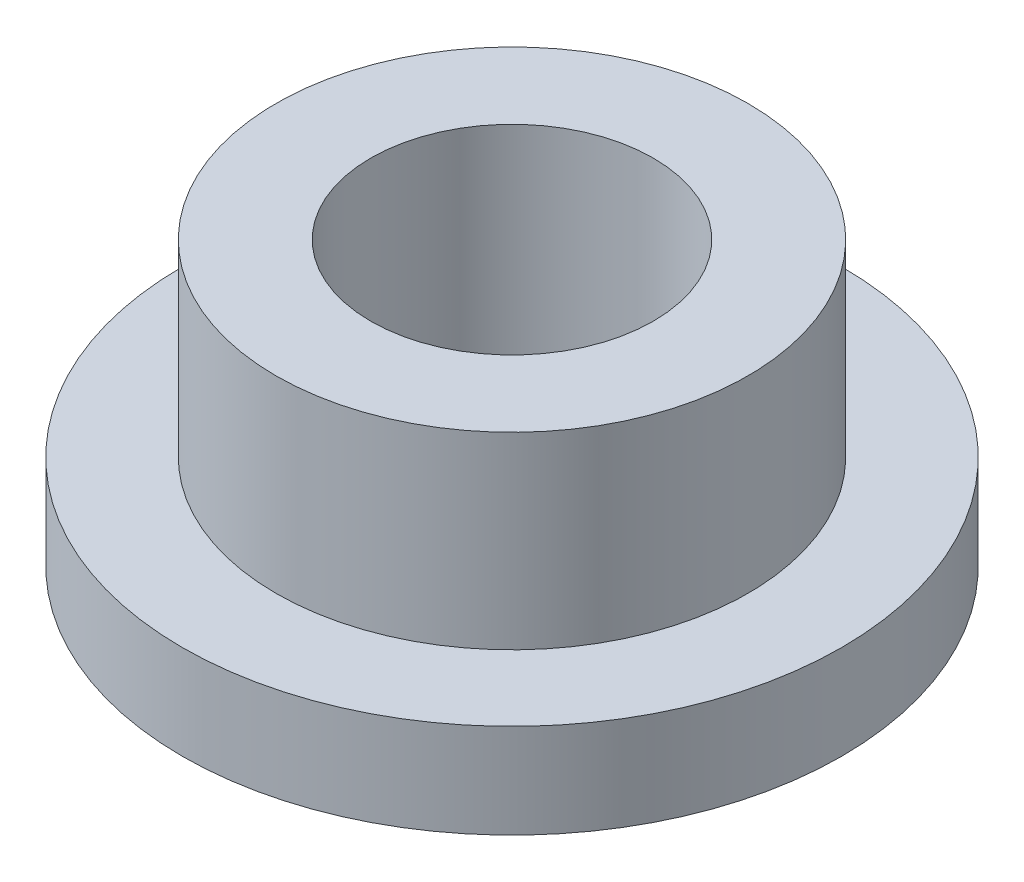
ISO-10303-21;
HEADER;
FILE_DESCRIPTION(('STEP AP214'),'2;1');
FILE_NAME('part.step','',(''),(''),'','','');
FILE_SCHEMA(('AUTOMOTIVE_DESIGN { 1 0 10303 214 1 1 1 1 }'));
ENDSEC;
DATA;
#1=APPLICATION_CONTEXT('core data for automotive mechanical design processes');
#2=APPLICATION_PROTOCOL_DEFINITION('international standard','automotive_design',2000,#1);
#3=PRODUCT_CONTEXT('',#1,'mechanical');
#4=PRODUCT('Part','Part','',(#3));
#5=PRODUCT_RELATED_PRODUCT_CATEGORY('part','',(#4));
#6=PRODUCT_DEFINITION_FORMATION('','',#4);
#7=PRODUCT_DEFINITION_CONTEXT('part definition',#1,'design');
#8=PRODUCT_DEFINITION('design','',#6,#7);
#9=PRODUCT_DEFINITION_SHAPE('','',#8);
#10=(LENGTH_UNIT() NAMED_UNIT(*) SI_UNIT(.MILLI.,.METRE.));
#11=(NAMED_UNIT(*) PLANE_ANGLE_UNIT() SI_UNIT($,.RADIAN.));
#12=(NAMED_UNIT(*) SI_UNIT($,.STERADIAN.) SOLID_ANGLE_UNIT());
#13=UNCERTAINTY_MEASURE_WITH_UNIT(LENGTH_MEASURE(1.E-05),#10,'distance_accuracy_value','');
#14=(GEOMETRIC_REPRESENTATION_CONTEXT(3) GLOBAL_UNCERTAINTY_ASSIGNED_CONTEXT((#13)) GLOBAL_UNIT_ASSIGNED_CONTEXT((#10,
#11,#12)) REPRESENTATION_CONTEXT('',''));
#15=CARTESIAN_POINT('',(0.,0.,0.));
#16=DIRECTION('',(0.,0.,1.));
#17=DIRECTION('',(1.,0.,0.));
#18=AXIS2_PLACEMENT_3D('',#15,#16,#17);
#19=CARTESIAN_POINT('',(0.,6.,0.));
#20=DIRECTION('',(0.,1.,0.));
#21=DIRECTION('',(0.,0.,1.));
#22=AXIS2_PLACEMENT_3D('',#19,#20,#21);
#23=PLANE('',#22);
#24=CARTESIAN_POINT('',(0.,6.,0.));
#25=DIRECTION('',(0.,1.,0.));
#26=DIRECTION('',(0.,0.,1.));
#27=AXIS2_PLACEMENT_3D('',#24,#25,#26);
#28=CIRCLE('',#27,5.01);
#29=CARTESIAN_POINT('',(0.,6.,5.01));
#30=VERTEX_POINT('',#29);
#31=EDGE_CURVE('E10',#30,#30,#28,.T.);
#32=ORIENTED_EDGE('',*,*,#31,.T.);
#33=EDGE_LOOP('',(#32));
#34=FACE_BOUND('',#33,.T.);
#35=CARTESIAN_POINT('',(0.,6.,0.));
#36=DIRECTION('',(0.,1.,0.));
#37=DIRECTION('',(0.,0.,1.));
#38=AXIS2_PLACEMENT_3D('',#35,#36,#37);
#39=CIRCLE('',#38,3.);
#40=CARTESIAN_POINT('',(0.,6.,3.));
#41=VERTEX_POINT('',#40);
#42=EDGE_CURVE('E38',#41,#41,#39,.T.);
#43=ORIENTED_EDGE('',*,*,#42,.F.);
#44=EDGE_LOOP('',(#43));
#45=FACE_BOUND('',#44,.T.);
#46=ADVANCED_FACE('F31',(#34,#45),#23,.T.);
#47=CARTESIAN_POINT('',(0.,0.,0.));
#48=DIRECTION('',(0.,1.,0.));
#49=DIRECTION('',(0.,0.,1.));
#50=AXIS2_PLACEMENT_3D('',#47,#48,#49);
#51=PLANE('',#50);
#52=CARTESIAN_POINT('',(0.,0.,0.));
#53=DIRECTION('',(0.,1.,0.));
#54=DIRECTION('',(0.,0.,1.));
#55=AXIS2_PLACEMENT_3D('',#52,#53,#54);
#56=CIRCLE('',#55,3.);
#57=CARTESIAN_POINT('',(0.,0.,3.));
#58=VERTEX_POINT('',#57);
#59=EDGE_CURVE('E42',#58,#58,#56,.T.);
#60=ORIENTED_EDGE('',*,*,#59,.T.);
#61=EDGE_LOOP('',(#60));
#62=FACE_BOUND('',#61,.T.);
#63=CARTESIAN_POINT('',(0.,0.,0.));
#64=DIRECTION('',(0.,1.,0.));
#65=DIRECTION('',(0.,0.,1.));
#66=AXIS2_PLACEMENT_3D('',#63,#64,#65);
#67=CIRCLE('',#66,7.);
#68=CARTESIAN_POINT('',(0.,0.,7.));
#69=VERTEX_POINT('',#68);
#70=EDGE_CURVE('E49',#69,#69,#67,.T.);
#71=ORIENTED_EDGE('',*,*,#70,.F.);
#72=EDGE_LOOP('',(#71));
#73=FACE_BOUND('',#72,.T.);
#74=ADVANCED_FACE('F74',(#62,#73),#51,.F.);
#75=CARTESIAN_POINT('',(0.,6.,0.));
#76=DIRECTION('',(0.,-1.,0.));
#77=DIRECTION('',(0.,0.,-1.));
#78=AXIS2_PLACEMENT_3D('',#75,#76,#77);
#79=CYLINDRICAL_SURFACE('',#78,5.01);
#80=CARTESIAN_POINT('',(0.,2.,0.));
#81=DIRECTION('',(0.,1.,0.));
#82=DIRECTION('',(0.,0.,1.));
#83=AXIS2_PLACEMENT_3D('',#80,#81,#82);
#84=CIRCLE('',#83,5.01);
#85=CARTESIAN_POINT('',(0.,2.,5.01));
#86=VERTEX_POINT('',#85);
#87=EDGE_CURVE('E52',#86,#86,#84,.T.);
#88=ORIENTED_EDGE('',*,*,#87,.T.);
#89=EDGE_LOOP('',(#88));
#90=FACE_BOUND('',#89,.T.);
#91=ORIENTED_EDGE('',*,*,#31,.F.);
#92=EDGE_LOOP('',(#91));
#93=FACE_BOUND('',#92,.T.);
#94=ADVANCED_FACE('F33',(#90,#93),#79,.T.);
#95=CARTESIAN_POINT('',(0.,6.,0.));
#96=DIRECTION('',(0.,-1.,0.));
#97=DIRECTION('',(0.,0.,-1.));
#98=AXIS2_PLACEMENT_3D('',#95,#96,#97);
#99=CYLINDRICAL_SURFACE('',#98,3.);
#100=ORIENTED_EDGE('',*,*,#42,.T.);
#101=EDGE_LOOP('',(#100));
#102=FACE_BOUND('',#101,.T.);
#103=ORIENTED_EDGE('',*,*,#59,.F.);
#104=EDGE_LOOP('',(#103));
#105=FACE_BOUND('',#104,.T.);
#106=ADVANCED_FACE('F63',(#102,#105),#99,.F.);
#107=CARTESIAN_POINT('',(0.,2.,0.));
#108=DIRECTION('',(0.,1.,0.));
#109=DIRECTION('',(0.,0.,1.));
#110=AXIS2_PLACEMENT_3D('',#107,#108,#109);
#111=PLANE('',#110);
#112=CARTESIAN_POINT('',(0.,2.,0.));
#113=DIRECTION('',(0.,1.,0.));
#114=DIRECTION('',(0.,0.,1.));
#115=AXIS2_PLACEMENT_3D('',#112,#113,#114);
#116=CIRCLE('',#115,7.);
#117=CARTESIAN_POINT('',(0.,2.,7.));
#118=VERTEX_POINT('',#117);
#119=EDGE_CURVE('E47',#118,#118,#116,.T.);
#120=ORIENTED_EDGE('',*,*,#119,.T.);
#121=EDGE_LOOP('',(#120));
#122=FACE_BOUND('',#121,.T.);
#123=ORIENTED_EDGE('',*,*,#87,.F.);
#124=EDGE_LOOP('',(#123));
#125=FACE_BOUND('',#124,.T.);
#126=ADVANCED_FACE('F60',(#122,#125),#111,.T.);
#127=CARTESIAN_POINT('',(0.,2.,0.));
#128=DIRECTION('',(0.,-1.,0.));
#129=DIRECTION('',(0.,0.,-1.));
#130=AXIS2_PLACEMENT_3D('',#127,#128,#129);
#131=CYLINDRICAL_SURFACE('',#130,7.);
#132=ORIENTED_EDGE('',*,*,#119,.F.);
#133=EDGE_LOOP('',(#132));
#134=FACE_BOUND('',#133,.T.);
#135=ORIENTED_EDGE('',*,*,#70,.T.);
#136=EDGE_LOOP('',(#135));
#137=FACE_BOUND('',#136,.T.);
#138=ADVANCED_FACE('F62',(#134,#137),#131,.T.);
#139=CLOSED_SHELL('',(#46,#74,#94,#106,#126,#138));
#140=MANIFOLD_SOLID_BREP('B2',#139);
#141=ADVANCED_BREP_SHAPE_REPRESENTATION('',(#18,#140),#14);
#142=SHAPE_DEFINITION_REPRESENTATION(#9,#141);
ENDSEC;
END-ISO-10303-21;
